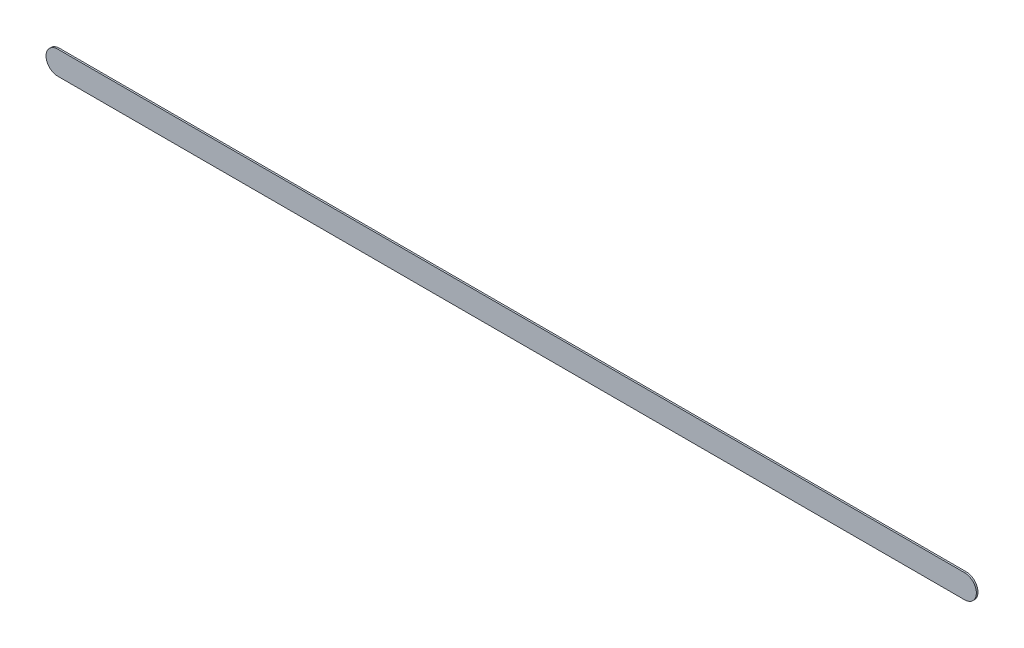
ISO-10303-21;
HEADER;
FILE_DESCRIPTION(('STEP AP214'),'2;1');
FILE_NAME('part.step','',(''),(''),'','','');
FILE_SCHEMA(('AUTOMOTIVE_DESIGN { 1 0 10303 214 1 1 1 1 }'));
ENDSEC;
DATA;
#1=APPLICATION_CONTEXT('core data for automotive mechanical design processes');
#2=APPLICATION_PROTOCOL_DEFINITION('international standard','automotive_design',2000,#1);
#3=PRODUCT_CONTEXT('',#1,'mechanical');
#4=PRODUCT('Part','Part','',(#3));
#5=PRODUCT_RELATED_PRODUCT_CATEGORY('part','',(#4));
#6=PRODUCT_DEFINITION_FORMATION('','',#4);
#7=PRODUCT_DEFINITION_CONTEXT('part definition',#1,'design');
#8=PRODUCT_DEFINITION('design','',#6,#7);
#9=PRODUCT_DEFINITION_SHAPE('','',#8);
#10=(LENGTH_UNIT() NAMED_UNIT(*) SI_UNIT(.MILLI.,.METRE.));
#11=(NAMED_UNIT(*) PLANE_ANGLE_UNIT() SI_UNIT($,.RADIAN.));
#12=(NAMED_UNIT(*) SI_UNIT($,.STERADIAN.) SOLID_ANGLE_UNIT());
#13=UNCERTAINTY_MEASURE_WITH_UNIT(LENGTH_MEASURE(1.E-05),#10,'distance_accuracy_value','');
#14=(GEOMETRIC_REPRESENTATION_CONTEXT(3) GLOBAL_UNCERTAINTY_ASSIGNED_CONTEXT((#13)) GLOBAL_UNIT_ASSIGNED_CONTEXT((#10,
#11,#12)) REPRESENTATION_CONTEXT('',''));
#15=CARTESIAN_POINT('',(0.,0.,0.));
#16=DIRECTION('',(0.,0.,1.));
#17=DIRECTION('',(1.,0.,0.));
#18=AXIS2_PLACEMENT_3D('',#15,#16,#17);
#19=CARTESIAN_POINT('',(167.64,-91.19,0.));
#20=DIRECTION('',(0.,0.,1.));
#21=DIRECTION('',(1.,0.,0.));
#22=AXIS2_PLACEMENT_3D('',#19,#20,#21);
#23=PLANE('',#22);
#24=DIRECTION('',(-1.,0.,0.));
#25=VECTOR('',#24,1.);
#26=CARTESIAN_POINT('',(167.64,-91.19,0.));
#27=LINE('',#26,#25);
#28=CARTESIAN_POINT('',(167.64,-91.19,0.));
#29=VERTEX_POINT('',#28);
#30=CARTESIAN_POINT('',(148.336,-91.19,0.));
#31=VERTEX_POINT('',#30);
#32=EDGE_CURVE('E98',#29,#31,#27,.T.);
#33=ORIENTED_EDGE('',*,*,#32,.T.);
#34=CARTESIAN_POINT('',(148.336,-91.44,0.));
#35=DIRECTION('',(0.,0.,1.));
#36=DIRECTION('',(0.,1.,0.));
#37=AXIS2_PLACEMENT_3D('',#34,#35,#36);
#38=CIRCLE('',#37,0.25);
#39=CARTESIAN_POINT('',(148.336,-91.69,0.));
#40=VERTEX_POINT('',#39);
#41=EDGE_CURVE('E77',#31,#40,#38,.T.);
#42=ORIENTED_EDGE('',*,*,#41,.T.);
#43=DIRECTION('',(1.,0.,0.));
#44=VECTOR('',#43,1.);
#45=CARTESIAN_POINT('',(148.336,-91.69,0.));
#46=LINE('',#45,#44);
#47=CARTESIAN_POINT('',(167.64,-91.69,0.));
#48=VERTEX_POINT('',#47);
#49=EDGE_CURVE('E82',#40,#48,#46,.T.);
#50=ORIENTED_EDGE('',*,*,#49,.T.);
#51=CARTESIAN_POINT('',(167.64,-91.44,0.));
#52=DIRECTION('',(0.,0.,1.));
#53=DIRECTION('',(0.,-1.,0.));
#54=AXIS2_PLACEMENT_3D('',#51,#52,#53);
#55=CIRCLE('',#54,0.25);
#56=EDGE_CURVE('E11',#48,#29,#55,.T.);
#57=ORIENTED_EDGE('',*,*,#56,.T.);
#58=EDGE_LOOP('',(#33,#42,#50,#57));
#59=FACE_BOUND('',#58,.T.);
#60=ADVANCED_FACE('F17',(#59),#23,.T.);
#61=CARTESIAN_POINT('',(167.64,-91.19,-0.035));
#62=DIRECTION('',(0.,0.,1.));
#63=DIRECTION('',(1.,0.,0.));
#64=AXIS2_PLACEMENT_3D('',#61,#62,#63);
#65=PLANE('',#64);
#66=CARTESIAN_POINT('',(167.64,-91.44,-0.035));
#67=DIRECTION('',(0.,0.,1.));
#68=DIRECTION('',(0.,-1.,0.));
#69=AXIS2_PLACEMENT_3D('',#66,#67,#68);
#70=CIRCLE('',#69,0.25);
#71=CARTESIAN_POINT('',(167.64,-91.69,-0.035));
#72=VERTEX_POINT('',#71);
#73=CARTESIAN_POINT('',(167.64,-91.19,-0.035));
#74=VERTEX_POINT('',#73);
#75=EDGE_CURVE('E25',#72,#74,#70,.T.);
#76=ORIENTED_EDGE('',*,*,#75,.F.);
#77=DIRECTION('',(1.,0.,0.));
#78=VECTOR('',#77,1.);
#79=CARTESIAN_POINT('',(148.336,-91.69,-0.035));
#80=LINE('',#79,#78);
#81=CARTESIAN_POINT('',(148.336,-91.69,-0.035));
#82=VERTEX_POINT('',#81);
#83=EDGE_CURVE('E67',#82,#72,#80,.T.);
#84=ORIENTED_EDGE('',*,*,#83,.F.);
#85=CARTESIAN_POINT('',(148.336,-91.44,-0.035));
#86=DIRECTION('',(0.,0.,1.));
#87=DIRECTION('',(0.,1.,0.));
#88=AXIS2_PLACEMENT_3D('',#85,#86,#87);
#89=CIRCLE('',#88,0.25);
#90=CARTESIAN_POINT('',(148.336,-91.19,-0.035));
#91=VERTEX_POINT('',#90);
#92=EDGE_CURVE('E71',#91,#82,#89,.T.);
#93=ORIENTED_EDGE('',*,*,#92,.F.);
#94=DIRECTION('',(-1.,0.,0.));
#95=VECTOR('',#94,1.);
#96=CARTESIAN_POINT('',(167.64,-91.19,-0.035));
#97=LINE('',#96,#95);
#98=EDGE_CURVE('E116',#74,#91,#97,.T.);
#99=ORIENTED_EDGE('',*,*,#98,.F.);
#100=EDGE_LOOP('',(#76,#84,#93,#99));
#101=FACE_BOUND('',#100,.T.);
#102=ADVANCED_FACE('F69',(#101),#65,.F.);
#103=CARTESIAN_POINT('',(167.64,-91.44,-0.035));
#104=DIRECTION('',(0.,0.,-1.));
#105=DIRECTION('',(0.,-1.,0.));
#106=AXIS2_PLACEMENT_3D('',#103,#104,#105);
#107=CYLINDRICAL_SURFACE('',#106,0.25);
#108=ORIENTED_EDGE('',*,*,#75,.T.);
#109=DIRECTION('',(0.,0.,1.));
#110=VECTOR('',#109,1.);
#111=CARTESIAN_POINT('',(167.64,-91.19,-0.035));
#112=LINE('',#111,#110);
#113=EDGE_CURVE('E92',#74,#29,#112,.T.);
#114=ORIENTED_EDGE('',*,*,#113,.T.);
#115=ORIENTED_EDGE('',*,*,#56,.F.);
#116=DIRECTION('',(0.,0.,1.));
#117=VECTOR('',#116,1.);
#118=CARTESIAN_POINT('',(167.64,-91.69,-0.035));
#119=LINE('',#118,#117);
#120=EDGE_CURVE('E76',#72,#48,#119,.T.);
#121=ORIENTED_EDGE('',*,*,#120,.F.);
#122=EDGE_LOOP('',(#108,#114,#115,#121));
#123=FACE_BOUND('',#122,.T.);
#124=ADVANCED_FACE('F125',(#123),#107,.T.);
#125=CARTESIAN_POINT('',(148.336,-91.69,-0.035));
#126=DIRECTION('',(0.,1.,0.));
#127=DIRECTION('',(1.,0.,0.));
#128=AXIS2_PLACEMENT_3D('',#125,#126,#127);
#129=PLANE('',#128);
#130=ORIENTED_EDGE('',*,*,#83,.T.);
#131=ORIENTED_EDGE('',*,*,#120,.T.);
#132=ORIENTED_EDGE('',*,*,#49,.F.);
#133=DIRECTION('',(0.,0.,1.));
#134=VECTOR('',#133,1.);
#135=CARTESIAN_POINT('',(148.336,-91.69,-0.035));
#136=LINE('',#135,#134);
#137=EDGE_CURVE('E80',#82,#40,#136,.T.);
#138=ORIENTED_EDGE('',*,*,#137,.F.);
#139=EDGE_LOOP('',(#130,#131,#132,#138));
#140=FACE_BOUND('',#139,.T.);
#141=ADVANCED_FACE('F81',(#140),#129,.F.);
#142=CARTESIAN_POINT('',(148.336,-91.44,-0.035));
#143=DIRECTION('',(0.,0.,-1.));
#144=DIRECTION('',(0.,1.,0.));
#145=AXIS2_PLACEMENT_3D('',#142,#143,#144);
#146=CYLINDRICAL_SURFACE('',#145,0.25);
#147=ORIENTED_EDGE('',*,*,#92,.T.);
#148=ORIENTED_EDGE('',*,*,#137,.T.);
#149=ORIENTED_EDGE('',*,*,#41,.F.);
#150=DIRECTION('',(0.,0.,1.));
#151=VECTOR('',#150,1.);
#152=CARTESIAN_POINT('',(148.336,-91.19,-0.035));
#153=LINE('',#152,#151);
#154=EDGE_CURVE('E89',#91,#31,#153,.T.);
#155=ORIENTED_EDGE('',*,*,#154,.F.);
#156=EDGE_LOOP('',(#147,#148,#149,#155));
#157=FACE_BOUND('',#156,.T.);
#158=ADVANCED_FACE('F87',(#157),#146,.T.);
#159=CARTESIAN_POINT('',(167.64,-91.19,-0.035));
#160=DIRECTION('',(0.,-1.,0.));
#161=DIRECTION('',(0.,0.,-1.));
#162=AXIS2_PLACEMENT_3D('',#159,#160,#161);
#163=PLANE('',#162);
#164=ORIENTED_EDGE('',*,*,#98,.T.);
#165=ORIENTED_EDGE('',*,*,#154,.T.);
#166=ORIENTED_EDGE('',*,*,#32,.F.);
#167=ORIENTED_EDGE('',*,*,#113,.F.);
#168=EDGE_LOOP('',(#164,#165,#166,#167));
#169=FACE_BOUND('',#168,.T.);
#170=ADVANCED_FACE('F122',(#169),#163,.F.);
#171=CLOSED_SHELL('',(#60,#102,#124,#141,#158,#170));
#172=MANIFOLD_SOLID_BREP('B1',#171);
#173=ADVANCED_BREP_SHAPE_REPRESENTATION('',(#18,#172),#14);
#174=SHAPE_DEFINITION_REPRESENTATION(#9,#173);
ENDSEC;
END-ISO-10303-21;
